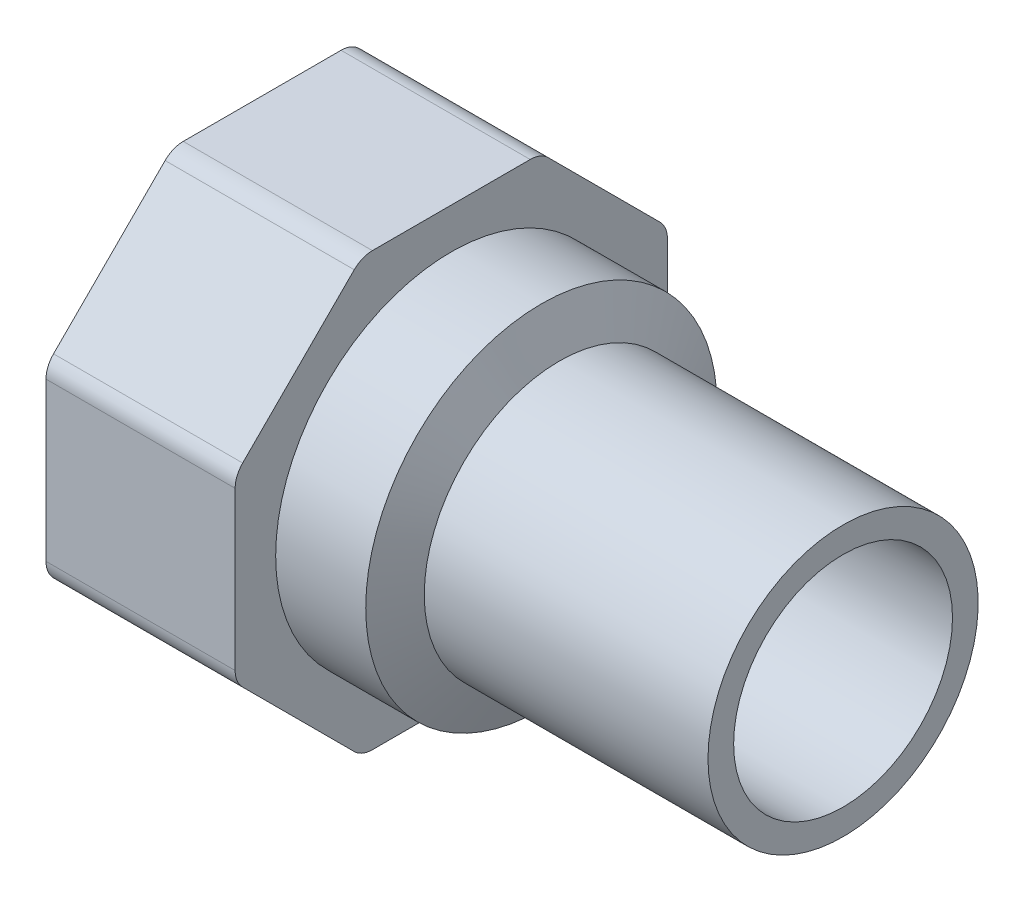
ISO-10303-21;
HEADER;
FILE_DESCRIPTION(('STEP AP214'),'2;1');
FILE_NAME('part.step','',(''),(''),'','','');
FILE_SCHEMA(('AUTOMOTIVE_DESIGN { 1 0 10303 214 1 1 1 1 }'));
ENDSEC;
DATA;
#1=APPLICATION_CONTEXT('core data for automotive mechanical design processes');
#2=APPLICATION_PROTOCOL_DEFINITION('international standard','automotive_design',2000,#1);
#3=PRODUCT_CONTEXT('',#1,'mechanical');
#4=PRODUCT('Part','Part','',(#3));
#5=PRODUCT_RELATED_PRODUCT_CATEGORY('part','',(#4));
#6=PRODUCT_DEFINITION_FORMATION('','',#4);
#7=PRODUCT_DEFINITION_CONTEXT('part definition',#1,'design');
#8=PRODUCT_DEFINITION('design','',#6,#7);
#9=PRODUCT_DEFINITION_SHAPE('','',#8);
#10=(LENGTH_UNIT() NAMED_UNIT(*) SI_UNIT(.MILLI.,.METRE.));
#11=(NAMED_UNIT(*) PLANE_ANGLE_UNIT() SI_UNIT($,.RADIAN.));
#12=(NAMED_UNIT(*) SI_UNIT($,.STERADIAN.) SOLID_ANGLE_UNIT());
#13=UNCERTAINTY_MEASURE_WITH_UNIT(LENGTH_MEASURE(1.E-05),#10,'distance_accuracy_value','');
#14=(GEOMETRIC_REPRESENTATION_CONTEXT(3) GLOBAL_UNCERTAINTY_ASSIGNED_CONTEXT((#13)) GLOBAL_UNIT_ASSIGNED_CONTEXT((#10,
#11,#12)) REPRESENTATION_CONTEXT('',''));
#15=CARTESIAN_POINT('',(0.,0.,0.));
#16=DIRECTION('',(0.,0.,1.));
#17=DIRECTION('',(1.,0.,0.));
#18=AXIS2_PLACEMENT_3D('',#15,#16,#17);
#19=CARTESIAN_POINT('',(-21.,0.,0.));
#20=DIRECTION('',(-1.,0.,0.));
#21=DIRECTION('',(0.,0.,1.));
#22=AXIS2_PLACEMENT_3D('',#19,#20,#21);
#23=CYLINDRICAL_SURFACE('',#22,10.);
#24=CARTESIAN_POINT('',(-21.,0.,0.));
#25=DIRECTION('',(1.,0.,0.));
#26=DIRECTION('',(0.,1.,0.));
#27=AXIS2_PLACEMENT_3D('',#24,#25,#26);
#28=CIRCLE('',#27,10.);
#29=CARTESIAN_POINT('',(-21.,10.,0.));
#30=VERTEX_POINT('',#29);
#31=EDGE_CURVE('E317',#30,#30,#28,.F.);
#32=ORIENTED_EDGE('',*,*,#31,.F.);
#33=EDGE_LOOP('',(#32));
#34=FACE_BOUND('',#33,.T.);
#35=CARTESIAN_POINT('',(0.,0.,0.));
#36=DIRECTION('',(-1.,0.,0.));
#37=DIRECTION('',(0.,0.,1.));
#38=AXIS2_PLACEMENT_3D('',#35,#36,#37);
#39=CIRCLE('',#38,10.);
#40=CARTESIAN_POINT('',(0.,0.,10.));
#41=VERTEX_POINT('',#40);
#42=EDGE_CURVE('E18',#41,#41,#39,.F.);
#43=ORIENTED_EDGE('',*,*,#42,.F.);
#44=EDGE_LOOP('',(#43));
#45=FACE_BOUND('',#44,.T.);
#46=ADVANCED_FACE('F15',(#34,#45),#23,.T.);
#47=CARTESIAN_POINT('',(-21.,0.,0.));
#48=DIRECTION('',(-1.,0.,0.));
#49=DIRECTION('',(0.,0.,1.));
#50=AXIS2_PLACEMENT_3D('',#47,#48,#49);
#51=CONICAL_SURFACE('',#50,10.,1.15257199721567);
#52=CARTESIAN_POINT('',(-22.3333333333333,0.,0.));
#53=DIRECTION('',(-1.,0.,0.));
#54=DIRECTION('',(0.,1.,0.));
#55=AXIS2_PLACEMENT_3D('',#52,#53,#54);
#56=CIRCLE('',#55,13.);
#57=CARTESIAN_POINT('',(-22.3333333333333,13.,0.));
#58=VERTEX_POINT('',#57);
#59=EDGE_CURVE('E309',#58,#58,#56,.T.);
#60=ORIENTED_EDGE('',*,*,#59,.F.);
#61=EDGE_LOOP('',(#60));
#62=FACE_BOUND('',#61,.T.);
#63=ORIENTED_EDGE('',*,*,#31,.T.);
#64=EDGE_LOOP('',(#63));
#65=FACE_BOUND('',#64,.T.);
#66=ADVANCED_FACE('F548',(#62,#65),#51,.T.);
#67=CARTESIAN_POINT('',(0.,10.,10.1200021082709));
#68=DIRECTION('',(1.,0.,0.));
#69=DIRECTION('',(0.,-1.,0.));
#70=AXIS2_PLACEMENT_3D('',#67,#68,#69);
#71=PLANE('',#70);
#72=CARTESIAN_POINT('',(0.,0.,0.));
#73=DIRECTION('',(-1.,0.,0.));
#74=DIRECTION('',(0.,0.,1.));
#75=AXIS2_PLACEMENT_3D('',#72,#73,#74);
#76=CIRCLE('',#75,8.1);
#77=CARTESIAN_POINT('',(0.,0.,8.1));
#78=VERTEX_POINT('',#77);
#79=EDGE_CURVE('E137',#78,#78,#76,.F.);
#80=ORIENTED_EDGE('',*,*,#79,.F.);
#81=EDGE_LOOP('',(#80));
#82=FACE_BOUND('',#81,.T.);
#83=ORIENTED_EDGE('',*,*,#42,.T.);
#84=EDGE_LOOP('',(#83));
#85=FACE_BOUND('',#84,.T.);
#86=ADVANCED_FACE('F540',(#82,#85),#71,.T.);
#87=CARTESIAN_POINT('',(-29.,0.,0.));
#88=DIRECTION('',(-1.,0.,0.));
#89=DIRECTION('',(0.,0.,1.));
#90=AXIS2_PLACEMENT_3D('',#87,#88,#89);
#91=CYLINDRICAL_SURFACE('',#90,13.);
#92=CARTESIAN_POINT('',(-29.,0.,0.));
#93=DIRECTION('',(-1.,0.,0.));
#94=DIRECTION('',(0.,0.,1.));
#95=AXIS2_PLACEMENT_3D('',#92,#93,#94);
#96=CIRCLE('',#95,13.);
#97=CARTESIAN_POINT('',(-29.,0.,13.));
#98=VERTEX_POINT('',#97);
#99=EDGE_CURVE('E285',#98,#98,#96,.T.);
#100=ORIENTED_EDGE('',*,*,#99,.F.);
#101=EDGE_LOOP('',(#100));
#102=FACE_BOUND('',#101,.T.);
#103=ORIENTED_EDGE('',*,*,#59,.T.);
#104=EDGE_LOOP('',(#103));
#105=FACE_BOUND('',#104,.T.);
#106=ADVANCED_FACE('F533',(#102,#105),#91,.T.);
#107=CARTESIAN_POINT('',(0.,0.,0.));
#108=DIRECTION('',(-1.,0.,0.));
#109=DIRECTION('',(0.,0.,1.));
#110=AXIS2_PLACEMENT_3D('',#107,#108,#109);
#111=CYLINDRICAL_SURFACE('',#110,8.1);
#112=ORIENTED_EDGE('',*,*,#79,.T.);
#113=EDGE_LOOP('',(#112));
#114=FACE_BOUND('',#113,.T.);
#115=CARTESIAN_POINT('',(-28.7868479254944,0.,0.));
#116=DIRECTION('',(1.,0.,0.));
#117=DIRECTION('',(0.,1.,0.));
#118=AXIS2_PLACEMENT_3D('',#115,#116,#117);
#119=CIRCLE('',#118,8.10000000000001);
#120=CARTESIAN_POINT('',(-28.7868479254944,8.10000000000001,0.));
#121=VERTEX_POINT('',#120);
#122=EDGE_CURVE('E165',#121,#121,#119,.T.);
#123=ORIENTED_EDGE('',*,*,#122,.F.);
#124=EDGE_LOOP('',(#123));
#125=FACE_BOUND('',#124,.T.);
#126=ADVANCED_FACE('F526',(#114,#125),#111,.F.);
#127=CARTESIAN_POINT('',(-29.,5.84041122946063,14.1));
#128=DIRECTION('',(1.,0.,0.));
#129=DIRECTION('',(0.,0.,-1.));
#130=AXIS2_PLACEMENT_3D('',#127,#128,#129);
#131=CYLINDRICAL_SURFACE('',#130,1.90000000000001);
#132=CARTESIAN_POINT('',(-43.,5.84041122946063,14.1));
#133=DIRECTION('',(1.,0.,0.));
#134=DIRECTION('',(0.,0.,-1.));
#135=AXIS2_PLACEMENT_3D('',#132,#133,#134);
#136=CIRCLE('',#135,1.90000000000001);
#137=CARTESIAN_POINT('',(-43.,7.18391411371508,15.4435028842544));
#138=VERTEX_POINT('',#137);
#139=CARTESIAN_POINT('',(-43.,5.84041122946063,16.));
#140=VERTEX_POINT('',#139);
#141=EDGE_CURVE('E125',#138,#140,#136,.T.);
#142=ORIENTED_EDGE('',*,*,#141,.T.);
#143=DIRECTION('',(1.,0.,0.));
#144=VECTOR('',#143,1.);
#145=CARTESIAN_POINT('',(-43.,5.84041122946064,16.));
#146=LINE('',#145,#144);
#147=CARTESIAN_POINT('',(-29.,5.84041122946063,16.));
#148=VERTEX_POINT('',#147);
#149=EDGE_CURVE('E131',#148,#140,#146,.F.);
#150=ORIENTED_EDGE('',*,*,#149,.F.);
#151=CARTESIAN_POINT('',(-29.,5.84041122946063,14.1));
#152=DIRECTION('',(1.,0.,0.));
#153=DIRECTION('',(0.,0.,-1.));
#154=AXIS2_PLACEMENT_3D('',#151,#152,#153);
#155=CIRCLE('',#154,1.90000000000001);
#156=CARTESIAN_POINT('',(-29.,7.18391411371508,15.4435028842544));
#157=VERTEX_POINT('',#156);
#158=EDGE_CURVE('E288',#157,#148,#155,.T.);
#159=ORIENTED_EDGE('',*,*,#158,.F.);
#160=DIRECTION('',(1.,0.,0.));
#161=VECTOR('',#160,1.);
#162=CARTESIAN_POINT('',(-43.,7.18391411371508,15.4435028842544));
#163=LINE('',#162,#161);
#164=EDGE_CURVE('E134',#138,#157,#163,.T.);
#165=ORIENTED_EDGE('',*,*,#164,.F.);
#166=EDGE_LOOP('',(#142,#150,#159,#165));
#167=FACE_BOUND('',#166,.T.);
#168=ADVANCED_FACE('F130',(#167),#131,.T.);
#169=CARTESIAN_POINT('',(-29.,14.1,5.84041122946064));
#170=DIRECTION('',(1.,0.,0.));
#171=DIRECTION('',(0.,0.,-1.));
#172=AXIS2_PLACEMENT_3D('',#169,#170,#171);
#173=CYLINDRICAL_SURFACE('',#172,1.90000000000001);
#174=CARTESIAN_POINT('',(-43.,14.1,5.84041122946064));
#175=DIRECTION('',(1.,0.,0.));
#176=DIRECTION('',(0.,0.,-1.));
#177=AXIS2_PLACEMENT_3D('',#174,#175,#176);
#178=CIRCLE('',#177,1.90000000000001);
#179=CARTESIAN_POINT('',(-43.,16.,5.84041122946064));
#180=VERTEX_POINT('',#179);
#181=CARTESIAN_POINT('',(-43.,15.4435028842544,7.18391411371509));
#182=VERTEX_POINT('',#181);
#183=EDGE_CURVE('E136',#180,#182,#178,.T.);
#184=ORIENTED_EDGE('',*,*,#183,.T.);
#185=DIRECTION('',(1.,0.,0.));
#186=VECTOR('',#185,1.);
#187=CARTESIAN_POINT('',(-43.,15.4435028842544,7.18391411371509));
#188=LINE('',#187,#186);
#189=CARTESIAN_POINT('',(-29.,15.4435028842544,7.18391411371509));
#190=VERTEX_POINT('',#189);
#191=EDGE_CURVE('E170',#190,#182,#188,.F.);
#192=ORIENTED_EDGE('',*,*,#191,.F.);
#193=CARTESIAN_POINT('',(-29.,14.1,5.84041122946064));
#194=DIRECTION('',(1.,0.,0.));
#195=DIRECTION('',(0.,0.,-1.));
#196=AXIS2_PLACEMENT_3D('',#193,#194,#195);
#197=CIRCLE('',#196,1.90000000000001);
#198=CARTESIAN_POINT('',(-29.,16.,5.84041122946064));
#199=VERTEX_POINT('',#198);
#200=EDGE_CURVE('E290',#199,#190,#197,.T.);
#201=ORIENTED_EDGE('',*,*,#200,.F.);
#202=DIRECTION('',(1.,0.,0.));
#203=VECTOR('',#202,1.);
#204=CARTESIAN_POINT('',(-43.,16.,5.84041122946065));
#205=LINE('',#204,#203);
#206=EDGE_CURVE('E178',#180,#199,#205,.T.);
#207=ORIENTED_EDGE('',*,*,#206,.F.);
#208=EDGE_LOOP('',(#184,#192,#201,#207));
#209=FACE_BOUND('',#208,.T.);
#210=ADVANCED_FACE('F511',(#209),#173,.T.);
#211=CARTESIAN_POINT('',(-29.,14.1,-5.84041122946064));
#212=DIRECTION('',(1.,0.,0.));
#213=DIRECTION('',(0.,0.,-1.));
#214=AXIS2_PLACEMENT_3D('',#211,#212,#213);
#215=CYLINDRICAL_SURFACE('',#214,1.89999999999998);
#216=CARTESIAN_POINT('',(-43.,14.1,-5.84041122946064));
#217=DIRECTION('',(1.,0.,0.));
#218=DIRECTION('',(0.,0.,-1.));
#219=AXIS2_PLACEMENT_3D('',#216,#217,#218);
#220=CIRCLE('',#219,1.89999999999998);
#221=CARTESIAN_POINT('',(-43.,15.4435028842544,-7.18391411371507));
#222=VERTEX_POINT('',#221);
#223=CARTESIAN_POINT('',(-43.,16.,-5.84041122946063));
#224=VERTEX_POINT('',#223);
#225=EDGE_CURVE('E306',#222,#224,#220,.T.);
#226=ORIENTED_EDGE('',*,*,#225,.T.);
#227=DIRECTION('',(1.,0.,0.));
#228=VECTOR('',#227,1.);
#229=CARTESIAN_POINT('',(-43.,16.,-5.84041122946063));
#230=LINE('',#229,#228);
#231=CARTESIAN_POINT('',(-29.,16.,-5.84041122946063));
#232=VERTEX_POINT('',#231);
#233=EDGE_CURVE('E177',#232,#224,#230,.F.);
#234=ORIENTED_EDGE('',*,*,#233,.F.);
#235=CARTESIAN_POINT('',(-29.,14.1,-5.84041122946064));
#236=DIRECTION('',(1.,0.,0.));
#237=DIRECTION('',(0.,0.,-1.));
#238=AXIS2_PLACEMENT_3D('',#235,#236,#237);
#239=CIRCLE('',#238,1.89999999999998);
#240=CARTESIAN_POINT('',(-29.,15.4435028842544,-7.18391411371507));
#241=VERTEX_POINT('',#240);
#242=EDGE_CURVE('E292',#241,#232,#239,.T.);
#243=ORIENTED_EDGE('',*,*,#242,.F.);
#244=DIRECTION('',(1.,0.,0.));
#245=VECTOR('',#244,1.);
#246=CARTESIAN_POINT('',(-43.,15.4435028842544,-7.18391411371507));
#247=LINE('',#246,#245);
#248=EDGE_CURVE('E187',#222,#241,#247,.T.);
#249=ORIENTED_EDGE('',*,*,#248,.F.);
#250=EDGE_LOOP('',(#226,#234,#243,#249));
#251=FACE_BOUND('',#250,.T.);
#252=ADVANCED_FACE('F503',(#251),#215,.T.);
#253=CARTESIAN_POINT('',(-29.,5.84041122946063,-14.1));
#254=DIRECTION('',(1.,0.,0.));
#255=DIRECTION('',(0.,0.,-1.));
#256=AXIS2_PLACEMENT_3D('',#253,#254,#255);
#257=CYLINDRICAL_SURFACE('',#256,1.90000000000001);
#258=CARTESIAN_POINT('',(-43.,5.84041122946063,-14.1));
#259=DIRECTION('',(1.,0.,0.));
#260=DIRECTION('',(0.,0.,-1.));
#261=AXIS2_PLACEMENT_3D('',#258,#259,#260);
#262=CIRCLE('',#261,1.90000000000001);
#263=CARTESIAN_POINT('',(-43.,5.84041122946063,-16.));
#264=VERTEX_POINT('',#263);
#265=CARTESIAN_POINT('',(-43.,7.18391411371508,-15.4435028842544));
#266=VERTEX_POINT('',#265);
#267=EDGE_CURVE('E304',#264,#266,#262,.T.);
#268=ORIENTED_EDGE('',*,*,#267,.T.);
#269=DIRECTION('',(1.,0.,0.));
#270=VECTOR('',#269,1.);
#271=CARTESIAN_POINT('',(-43.,7.18391411371508,-15.4435028842544));
#272=LINE('',#271,#270);
#273=CARTESIAN_POINT('',(-29.,7.18391411371508,-15.4435028842544));
#274=VERTEX_POINT('',#273);
#275=EDGE_CURVE('E186',#274,#266,#272,.F.);
#276=ORIENTED_EDGE('',*,*,#275,.F.);
#277=CARTESIAN_POINT('',(-29.,5.84041122946063,-14.1));
#278=DIRECTION('',(1.,0.,0.));
#279=DIRECTION('',(0.,0.,-1.));
#280=AXIS2_PLACEMENT_3D('',#277,#278,#279);
#281=CIRCLE('',#280,1.90000000000001);
#282=CARTESIAN_POINT('',(-29.,5.84041122946063,-16.));
#283=VERTEX_POINT('',#282);
#284=EDGE_CURVE('E294',#283,#274,#281,.T.);
#285=ORIENTED_EDGE('',*,*,#284,.F.);
#286=DIRECTION('',(1.,0.,0.));
#287=VECTOR('',#286,1.);
#288=CARTESIAN_POINT('',(-43.,5.84041122946064,-16.));
#289=LINE('',#288,#287);
#290=EDGE_CURVE('E196',#264,#283,#289,.T.);
#291=ORIENTED_EDGE('',*,*,#290,.F.);
#292=EDGE_LOOP('',(#268,#276,#285,#291));
#293=FACE_BOUND('',#292,.T.);
#294=ADVANCED_FACE('F495',(#293),#257,.T.);
#295=CARTESIAN_POINT('',(-29.,-5.84041122946063,-14.1));
#296=DIRECTION('',(1.,0.,0.));
#297=DIRECTION('',(0.,0.,-1.));
#298=AXIS2_PLACEMENT_3D('',#295,#296,#297);
#299=CYLINDRICAL_SURFACE('',#298,1.9);
#300=CARTESIAN_POINT('',(-43.,-5.84041122946063,-14.1));
#301=DIRECTION('',(1.,0.,0.));
#302=DIRECTION('',(0.,0.,-1.));
#303=AXIS2_PLACEMENT_3D('',#300,#301,#302);
#304=CIRCLE('',#303,1.9);
#305=CARTESIAN_POINT('',(-43.,-7.18391411371507,-15.4435028842544));
#306=VERTEX_POINT('',#305);
#307=CARTESIAN_POINT('',(-43.,-5.84041122946063,-16.));
#308=VERTEX_POINT('',#307);
#309=EDGE_CURVE('E302',#306,#308,#304,.T.);
#310=ORIENTED_EDGE('',*,*,#309,.T.);
#311=DIRECTION('',(1.,0.,0.));
#312=VECTOR('',#311,1.);
#313=CARTESIAN_POINT('',(-43.,-5.84041122946063,-16.));
#314=LINE('',#313,#312);
#315=CARTESIAN_POINT('',(-29.,-5.84041122946063,-16.));
#316=VERTEX_POINT('',#315);
#317=EDGE_CURVE('E195',#316,#308,#314,.F.);
#318=ORIENTED_EDGE('',*,*,#317,.F.);
#319=CARTESIAN_POINT('',(-29.,-5.84041122946063,-14.1));
#320=DIRECTION('',(1.,0.,0.));
#321=DIRECTION('',(0.,0.,-1.));
#322=AXIS2_PLACEMENT_3D('',#319,#320,#321);
#323=CIRCLE('',#322,1.9);
#324=CARTESIAN_POINT('',(-29.,-7.18391411371507,-15.4435028842544));
#325=VERTEX_POINT('',#324);
#326=EDGE_CURVE('E296',#325,#316,#323,.T.);
#327=ORIENTED_EDGE('',*,*,#326,.F.);
#328=DIRECTION('',(1.,0.,0.));
#329=VECTOR('',#328,1.);
#330=CARTESIAN_POINT('',(-43.,-7.18391411371507,-15.4435028842544));
#331=LINE('',#330,#329);
#332=EDGE_CURVE('E205',#306,#325,#331,.T.);
#333=ORIENTED_EDGE('',*,*,#332,.F.);
#334=EDGE_LOOP('',(#310,#318,#327,#333));
#335=FACE_BOUND('',#334,.T.);
#336=ADVANCED_FACE('F487',(#335),#299,.T.);
#337=CARTESIAN_POINT('',(-29.,-14.1,-5.84041122946064));
#338=DIRECTION('',(1.,0.,0.));
#339=DIRECTION('',(0.,0.,-1.));
#340=AXIS2_PLACEMENT_3D('',#337,#338,#339);
#341=CYLINDRICAL_SURFACE('',#340,1.9);
#342=CARTESIAN_POINT('',(-43.,-14.1,-5.84041122946064));
#343=DIRECTION('',(1.,0.,0.));
#344=DIRECTION('',(0.,0.,-1.));
#345=AXIS2_PLACEMENT_3D('',#342,#343,#344);
#346=CIRCLE('',#345,1.9);
#347=CARTESIAN_POINT('',(-43.,-16.,-5.84041122946064));
#348=VERTEX_POINT('',#347);
#349=CARTESIAN_POINT('',(-43.,-15.4435028842544,-7.18391411371508));
#350=VERTEX_POINT('',#349);
#351=EDGE_CURVE('E300',#348,#350,#346,.T.);
#352=ORIENTED_EDGE('',*,*,#351,.T.);
#353=DIRECTION('',(1.,0.,0.));
#354=VECTOR('',#353,1.);
#355=CARTESIAN_POINT('',(-43.,-15.4435028842544,-7.18391411371508));
#356=LINE('',#355,#354);
#357=CARTESIAN_POINT('',(-29.,-15.4435028842544,-7.18391411371508));
#358=VERTEX_POINT('',#357);
#359=EDGE_CURVE('E204',#358,#350,#356,.F.);
#360=ORIENTED_EDGE('',*,*,#359,.F.);
#361=CARTESIAN_POINT('',(-29.,-14.1,-5.84041122946064));
#362=DIRECTION('',(1.,0.,0.));
#363=DIRECTION('',(0.,0.,-1.));
#364=AXIS2_PLACEMENT_3D('',#361,#362,#363);
#365=CIRCLE('',#364,1.9);
#366=CARTESIAN_POINT('',(-29.,-16.,-5.84041122946064));
#367=VERTEX_POINT('',#366);
#368=EDGE_CURVE('E298',#367,#358,#365,.T.);
#369=ORIENTED_EDGE('',*,*,#368,.F.);
#370=DIRECTION('',(1.,0.,0.));
#371=VECTOR('',#370,1.);
#372=CARTESIAN_POINT('',(-43.,-16.,-5.84041122946065));
#373=LINE('',#372,#371);
#374=EDGE_CURVE('E211',#348,#367,#373,.T.);
#375=ORIENTED_EDGE('',*,*,#374,.F.);
#376=EDGE_LOOP('',(#352,#360,#369,#375));
#377=FACE_BOUND('',#376,.T.);
#378=ADVANCED_FACE('F479',(#377),#341,.T.);
#379=CARTESIAN_POINT('',(-29.,16.,16.));
#380=DIRECTION('',(1.,0.,0.));
#381=DIRECTION('',(0.,-1.,0.));
#382=AXIS2_PLACEMENT_3D('',#379,#380,#381);
#383=PLANE('',#382);
#384=ORIENTED_EDGE('',*,*,#99,.T.);
#385=EDGE_LOOP('',(#384));
#386=FACE_BOUND('',#385,.T.);
#387=ORIENTED_EDGE('',*,*,#158,.T.);
#388=DIRECTION('',(0.,1.,0.));
#389=VECTOR('',#388,1.);
#390=CARTESIAN_POINT('',(-29.,0.,16.));
#391=LINE('',#390,#389);
#392=CARTESIAN_POINT('',(-29.,-5.84041122946064,16.));
#393=VERTEX_POINT('',#392);
#394=EDGE_CURVE('E144',#393,#148,#391,.T.);
#395=ORIENTED_EDGE('',*,*,#394,.F.);
#396=CARTESIAN_POINT('',(-29.,-5.84041122946064,14.1));
#397=DIRECTION('',(1.,0.,0.));
#398=DIRECTION('',(0.,0.,-1.));
#399=AXIS2_PLACEMENT_3D('',#396,#397,#398);
#400=CIRCLE('',#399,1.89999999999999);
#401=CARTESIAN_POINT('',(-29.,-7.18391411371508,15.4435028842544));
#402=VERTEX_POINT('',#401);
#403=EDGE_CURVE('E276',#402,#393,#400,.F.);
#404=ORIENTED_EDGE('',*,*,#403,.F.);
#405=DIRECTION('',(0.,0.707106781186547,0.707106781186548));
#406=VECTOR('',#405,1.);
#407=CARTESIAN_POINT('',(-29.,-11.3137084989848,11.3137084989848));
#408=LINE('',#407,#406);
#409=CARTESIAN_POINT('',(-29.,-15.4435028842544,7.18391411371507));
#410=VERTEX_POINT('',#409);
#411=EDGE_CURVE('E164',#410,#402,#408,.T.);
#412=ORIENTED_EDGE('',*,*,#411,.F.);
#413=CARTESIAN_POINT('',(-29.,-14.1,5.84041122946064));
#414=DIRECTION('',(1.,0.,0.));
#415=DIRECTION('',(0.,0.,-1.));
#416=AXIS2_PLACEMENT_3D('',#413,#414,#415);
#417=CIRCLE('',#416,1.89999999999999);
#418=CARTESIAN_POINT('',(-29.,-16.,5.84041122946063));
#419=VERTEX_POINT('',#418);
#420=EDGE_CURVE('E273',#419,#410,#417,.F.);
#421=ORIENTED_EDGE('',*,*,#420,.F.);
#422=DIRECTION('',(0.,0.,1.));
#423=VECTOR('',#422,1.);
#424=CARTESIAN_POINT('',(-29.,-16.,0.));
#425=LINE('',#424,#423);
#426=EDGE_CURVE('E208',#367,#419,#425,.T.);
#427=ORIENTED_EDGE('',*,*,#426,.F.);
#428=ORIENTED_EDGE('',*,*,#368,.T.);
#429=DIRECTION('',(0.,-0.707106781186547,0.707106781186548));
#430=VECTOR('',#429,1.);
#431=CARTESIAN_POINT('',(-29.,-11.3137084989847,-11.3137084989848));
#432=LINE('',#431,#430);
#433=EDGE_CURVE('E199',#325,#358,#432,.T.);
#434=ORIENTED_EDGE('',*,*,#433,.F.);
#435=ORIENTED_EDGE('',*,*,#326,.T.);
#436=DIRECTION('',(0.,-1.,0.));
#437=VECTOR('',#436,1.);
#438=CARTESIAN_POINT('',(-29.,0.,-16.));
#439=LINE('',#438,#437);
#440=EDGE_CURVE('E190',#283,#316,#439,.T.);
#441=ORIENTED_EDGE('',*,*,#440,.F.);
#442=ORIENTED_EDGE('',*,*,#284,.T.);
#443=DIRECTION('',(0.,-0.707106781186547,-0.707106781186548));
#444=VECTOR('',#443,1.);
#445=CARTESIAN_POINT('',(-29.,11.3137084989848,-11.3137084989848));
#446=LINE('',#445,#444);
#447=EDGE_CURVE('E181',#241,#274,#446,.T.);
#448=ORIENTED_EDGE('',*,*,#447,.F.);
#449=ORIENTED_EDGE('',*,*,#242,.T.);
#450=DIRECTION('',(0.,0.,-1.));
#451=VECTOR('',#450,1.);
#452=CARTESIAN_POINT('',(-29.,16.,0.));
#453=LINE('',#452,#451);
#454=EDGE_CURVE('E172',#199,#232,#453,.T.);
#455=ORIENTED_EDGE('',*,*,#454,.F.);
#456=ORIENTED_EDGE('',*,*,#200,.T.);
#457=DIRECTION('',(0.,0.707106781186547,-0.707106781186548));
#458=VECTOR('',#457,1.);
#459=CARTESIAN_POINT('',(-29.,11.3137084989848,11.3137084989848));
#460=LINE('',#459,#458);
#461=EDGE_CURVE('E167',#157,#190,#460,.T.);
#462=ORIENTED_EDGE('',*,*,#461,.F.);
#463=EDGE_LOOP('',(#387,#395,#404,#412,#421,#427,#428,#434,#435,#441,#442,#448,#449,#455,#456,#462));
#464=FACE_BOUND('',#463,.T.);
#465=ADVANCED_FACE('F271',(#386,#464),#383,.T.);
#466=CARTESIAN_POINT('',(-29.,-5.84041122946064,14.1));
#467=DIRECTION('',(1.,0.,0.));
#468=DIRECTION('',(0.,0.,-1.));
#469=AXIS2_PLACEMENT_3D('',#466,#467,#468);
#470=CYLINDRICAL_SURFACE('',#469,1.89999999999999);
#471=CARTESIAN_POINT('',(-43.,-5.84041122946064,14.1));
#472=DIRECTION('',(1.,0.,0.));
#473=DIRECTION('',(0.,0.,-1.));
#474=AXIS2_PLACEMENT_3D('',#471,#472,#473);
#475=CIRCLE('',#474,1.89999999999999);
#476=CARTESIAN_POINT('',(-43.,-5.84041122946064,16.));
#477=VERTEX_POINT('',#476);
#478=CARTESIAN_POINT('',(-43.,-7.18391411371508,15.4435028842544));
#479=VERTEX_POINT('',#478);
#480=EDGE_CURVE('E148',#477,#479,#475,.T.);
#481=ORIENTED_EDGE('',*,*,#480,.T.);
#482=DIRECTION('',(1.,0.,0.));
#483=VECTOR('',#482,1.);
#484=CARTESIAN_POINT('',(-43.,-7.18391411371508,15.4435028842544));
#485=LINE('',#484,#483);
#486=EDGE_CURVE('E161',#402,#479,#485,.F.);
#487=ORIENTED_EDGE('',*,*,#486,.F.);
#488=ORIENTED_EDGE('',*,*,#403,.T.);
#489=DIRECTION('',(1.,0.,0.));
#490=VECTOR('',#489,1.);
#491=CARTESIAN_POINT('',(-43.,-5.84041122946064,16.));
#492=LINE('',#491,#490);
#493=EDGE_CURVE('E145',#477,#393,#492,.T.);
#494=ORIENTED_EDGE('',*,*,#493,.F.);
#495=EDGE_LOOP('',(#481,#487,#488,#494));
#496=FACE_BOUND('',#495,.T.);
#497=ADVANCED_FACE('F465',(#496),#470,.T.);
#498=CARTESIAN_POINT('',(-29.,-14.1,5.84041122946064));
#499=DIRECTION('',(1.,0.,0.));
#500=DIRECTION('',(0.,0.,-1.));
#501=AXIS2_PLACEMENT_3D('',#498,#499,#500);
#502=CYLINDRICAL_SURFACE('',#501,1.89999999999999);
#503=CARTESIAN_POINT('',(-43.,-14.1,5.84041122946064));
#504=DIRECTION('',(1.,0.,0.));
#505=DIRECTION('',(0.,0.,-1.));
#506=AXIS2_PLACEMENT_3D('',#503,#504,#505);
#507=CIRCLE('',#506,1.89999999999999);
#508=CARTESIAN_POINT('',(-43.,-15.4435028842544,7.18391411371507));
#509=VERTEX_POINT('',#508);
#510=CARTESIAN_POINT('',(-43.,-16.,5.84041122946063));
#511=VERTEX_POINT('',#510);
#512=EDGE_CURVE('E33',#509,#511,#507,.T.);
#513=ORIENTED_EDGE('',*,*,#512,.T.);
#514=DIRECTION('',(1.,0.,0.));
#515=VECTOR('',#514,1.);
#516=CARTESIAN_POINT('',(-43.,-16.,5.84041122946063));
#517=LINE('',#516,#515);
#518=EDGE_CURVE('E214',#419,#511,#517,.F.);
#519=ORIENTED_EDGE('',*,*,#518,.F.);
#520=ORIENTED_EDGE('',*,*,#420,.T.);
#521=DIRECTION('',(1.,0.,0.));
#522=VECTOR('',#521,1.);
#523=CARTESIAN_POINT('',(-43.,-15.4435028842544,7.18391411371507));
#524=LINE('',#523,#522);
#525=EDGE_CURVE('E156',#509,#410,#524,.T.);
#526=ORIENTED_EDGE('',*,*,#525,.F.);
#527=EDGE_LOOP('',(#513,#519,#520,#526));
#528=FACE_BOUND('',#527,.T.);
#529=ADVANCED_FACE('F278',(#528),#502,.T.);
#530=CARTESIAN_POINT('',(-29.,0.,0.));
#531=DIRECTION('',(-1.,0.,0.));
#532=DIRECTION('',(0.,0.,1.));
#533=AXIS2_PLACEMENT_3D('',#530,#531,#532);
#534=CONICAL_SURFACE('',#533,8.46919022278247,1.0471975511966);
#535=ORIENTED_EDGE('',*,*,#122,.T.);
#536=EDGE_LOOP('',(#535));
#537=FACE_BOUND('',#536,.T.);
#538=CARTESIAN_POINT('',(-29.,0.,0.));
#539=DIRECTION('',(1.,0.,0.));
#540=DIRECTION('',(0.,1.,0.));
#541=AXIS2_PLACEMENT_3D('',#538,#539,#540);
#542=CIRCLE('',#541,8.46919022278247);
#543=CARTESIAN_POINT('',(-29.,8.46919022278247,0.));
#544=VERTEX_POINT('',#543);
#545=EDGE_CURVE('E151',#544,#544,#542,.T.);
#546=ORIENTED_EDGE('',*,*,#545,.F.);
#547=EDGE_LOOP('',(#546));
#548=FACE_BOUND('',#547,.T.);
#549=ADVANCED_FACE('F451',(#537,#548),#534,.F.);
#550=CARTESIAN_POINT('',(-43.,5.84041122946064,16.));
#551=DIRECTION('',(0.,0.,1.));
#552=DIRECTION('',(0.,-1.,0.));
#553=AXIS2_PLACEMENT_3D('',#550,#551,#552);
#554=PLANE('',#553);
#555=DIRECTION('',(0.,1.,0.));
#556=VECTOR('',#555,1.);
#557=CARTESIAN_POINT('',(-43.,0.,16.));
#558=LINE('',#557,#556);
#559=EDGE_CURVE('E143',#477,#140,#558,.T.);
#560=ORIENTED_EDGE('',*,*,#559,.F.);
#561=ORIENTED_EDGE('',*,*,#493,.T.);
#562=ORIENTED_EDGE('',*,*,#394,.T.);
#563=ORIENTED_EDGE('',*,*,#149,.T.);
#564=EDGE_LOOP('',(#560,#561,#562,#563));
#565=FACE_BOUND('',#564,.T.);
#566=ADVANCED_FACE('F141',(#565),#554,.T.);
#567=CARTESIAN_POINT('',(-43.,15.4435028842544,7.18391411371509));
#568=DIRECTION('',(0.,0.707106781186548,0.707106781186547));
#569=DIRECTION('',(0.,-0.707106781186547,0.707106781186548));
#570=AXIS2_PLACEMENT_3D('',#567,#568,#569);
#571=PLANE('',#570);
#572=CARTESIAN_POINT('',(-43.,7.18391411371508,15.4435028842544));
#573=CARTESIAN_POINT('',(-43.,7.52806364582089,15.0993533521486));
#574=CARTESIAN_POINT('',(-43.,7.87221317792669,14.7552038200428));
#575=CARTESIAN_POINT('',(-43.,8.56051224213831,14.0669047558312));
#576=CARTESIAN_POINT('',(-43.,8.90466177424411,13.7227552237254));
#577=CARTESIAN_POINT('',(-43.,9.59296083845572,13.0344561595138));
#578=CARTESIAN_POINT('',(-43.,9.93711037056153,12.690306627408));
#579=CARTESIAN_POINT('',(-43.,10.6254094347731,12.0020075631964));
#580=CARTESIAN_POINT('',(-43.,10.9695589668789,11.6578580310906));
#581=CARTESIAN_POINT('',(-43.,11.6578580310906,10.969558966879));
#582=CARTESIAN_POINT('',(-43.,12.0020075631964,10.6254094347732));
#583=CARTESIAN_POINT('',(-43.,12.690306627408,9.93711037056154));
#584=CARTESIAN_POINT('',(-43.,13.0344561595138,9.59296083845573));
#585=CARTESIAN_POINT('',(-43.,13.7227552237254,8.90466177424412));
#586=CARTESIAN_POINT('',(-43.,14.0669047558312,8.56051224213831));
#587=CARTESIAN_POINT('',(-43.,14.7552038200428,7.8722131779267));
#588=CARTESIAN_POINT('',(-43.,15.0993533521486,7.5280636458209));
#589=CARTESIAN_POINT('',(-43.,15.4435028842544,7.18391411371509));
#590=B_SPLINE_CURVE_WITH_KNOTS('',3,(#572,#573,#574,#575,#576,#577,#578,#579,#580,#581,#582,
#583,#584,#585,#586,#587,#588,#589),.UNSPECIFIED.,.F.,.F.,(4,2,2,2,2,2,2,2,4),(0.,
1.46010280736516,2.92020561473032,4.38030842209548,5.84041122946063,7.3005140368258,
8.76061684419095,10.2207196515561,11.6808224589213),.UNSPECIFIED.);
#591=EDGE_CURVE('E150',#138,#182,#590,.T.);
#592=ORIENTED_EDGE('',*,*,#591,.F.);
#593=ORIENTED_EDGE('',*,*,#164,.T.);
#594=ORIENTED_EDGE('',*,*,#461,.T.);
#595=ORIENTED_EDGE('',*,*,#191,.T.);
#596=EDGE_LOOP('',(#592,#593,#594,#595));
#597=FACE_BOUND('',#596,.T.);
#598=ADVANCED_FACE('F436',(#597),#571,.T.);
#599=CARTESIAN_POINT('',(-43.,16.,-5.84041122946063));
#600=DIRECTION('',(0.,1.,0.));
#601=DIRECTION('',(0.,0.,1.));
#602=AXIS2_PLACEMENT_3D('',#599,#600,#601);
#603=PLANE('',#602);
#604=DIRECTION('',(0.,0.,-1.));
#605=VECTOR('',#604,1.);
#606=CARTESIAN_POINT('',(-43.,16.,16.));
#607=LINE('',#606,#605);
#608=EDGE_CURVE('E153',#180,#224,#607,.T.);
#609=ORIENTED_EDGE('',*,*,#608,.F.);
#610=ORIENTED_EDGE('',*,*,#206,.T.);
#611=ORIENTED_EDGE('',*,*,#454,.T.);
#612=ORIENTED_EDGE('',*,*,#233,.T.);
#613=EDGE_LOOP('',(#609,#610,#611,#612));
#614=FACE_BOUND('',#613,.T.);
#615=ADVANCED_FACE('F428',(#614),#603,.T.);
#616=CARTESIAN_POINT('',(-43.,7.18391411371508,-15.4435028842544));
#617=DIRECTION('',(0.,0.707106781186548,-0.707106781186547));
#618=DIRECTION('',(0.,0.707106781186547,0.707106781186548));
#619=AXIS2_PLACEMENT_3D('',#616,#617,#618);
#620=PLANE('',#619);
#621=CARTESIAN_POINT('',(-43.,15.4435028842544,-7.18391411371507));
#622=CARTESIAN_POINT('',(-43.,15.0993533521486,-7.52806364582088));
#623=CARTESIAN_POINT('',(-43.,14.7552038200428,-7.87221317792668));
#624=CARTESIAN_POINT('',(-43.,14.0669047558312,-8.56051224213829));
#625=CARTESIAN_POINT('',(-43.,13.7227552237254,-8.9046617742441));
#626=CARTESIAN_POINT('',(-43.,13.0344561595138,-9.59296083845572));
#627=CARTESIAN_POINT('',(-43.,12.690306627408,-9.93711037056153));
#628=CARTESIAN_POINT('',(-43.,12.0020075631964,-10.6254094347731));
#629=CARTESIAN_POINT('',(-43.,11.6578580310906,-10.9695589668789));
#630=CARTESIAN_POINT('',(-43.,10.9695589668789,-11.6578580310906));
#631=CARTESIAN_POINT('',(-43.,10.6254094347731,-12.0020075631964));
#632=CARTESIAN_POINT('',(-43.,9.93711037056153,-12.690306627408));
#633=CARTESIAN_POINT('',(-43.,9.59296083845572,-13.0344561595138));
#634=CARTESIAN_POINT('',(-43.,8.90466177424411,-13.7227552237254));
#635=CARTESIAN_POINT('',(-43.,8.56051224213831,-14.0669047558312));
#636=CARTESIAN_POINT('',(-43.,7.87221317792669,-14.7552038200428));
#637=CARTESIAN_POINT('',(-43.,7.52806364582089,-15.0993533521486));
#638=CARTESIAN_POINT('',(-43.,7.18391411371508,-15.4435028842544));
#639=B_SPLINE_CURVE_WITH_KNOTS('',3,(#621,#622,#623,#624,#625,#626,#627,#628,#629,#630,#631,
#632,#633,#634,#635,#636,#637,#638),.UNSPECIFIED.,.F.,.F.,(4,2,2,2,2,2,2,2,4),(0.,
1.46010280736516,2.92020561473032,4.38030842209548,5.84041122946064,7.3005140368258,
8.76061684419096,10.2207196515561,11.6808224589213),.UNSPECIFIED.);
#640=EDGE_CURVE('E587',#222,#266,#639,.T.);
#641=ORIENTED_EDGE('',*,*,#640,.F.);
#642=ORIENTED_EDGE('',*,*,#248,.T.);
#643=ORIENTED_EDGE('',*,*,#447,.T.);
#644=ORIENTED_EDGE('',*,*,#275,.T.);
#645=EDGE_LOOP('',(#641,#642,#643,#644));
#646=FACE_BOUND('',#645,.T.);
#647=ADVANCED_FACE('F420',(#646),#620,.T.);
#648=CARTESIAN_POINT('',(-43.,-5.84041122946063,-16.));
#649=DIRECTION('',(0.,0.,-1.));
#650=DIRECTION('',(0.,1.,0.));
#651=AXIS2_PLACEMENT_3D('',#648,#649,#650);
#652=PLANE('',#651);
#653=DIRECTION('',(0.,-1.,0.));
#654=VECTOR('',#653,1.);
#655=CARTESIAN_POINT('',(-43.,0.,-16.));
#656=LINE('',#655,#654);
#657=EDGE_CURVE('E221',#264,#308,#656,.T.);
#658=ORIENTED_EDGE('',*,*,#657,.F.);
#659=ORIENTED_EDGE('',*,*,#290,.T.);
#660=ORIENTED_EDGE('',*,*,#440,.T.);
#661=ORIENTED_EDGE('',*,*,#317,.T.);
#662=EDGE_LOOP('',(#658,#659,#660,#661));
#663=FACE_BOUND('',#662,.T.);
#664=ADVANCED_FACE('F412',(#663),#652,.T.);
#665=CARTESIAN_POINT('',(-43.,-15.4435028842544,-7.18391411371508));
#666=DIRECTION('',(0.,-0.707106781186548,-0.707106781186547));
#667=DIRECTION('',(0.,0.707106781186547,-0.707106781186548));
#668=AXIS2_PLACEMENT_3D('',#665,#666,#667);
#669=PLANE('',#668);
#670=CARTESIAN_POINT('',(-43.,-7.18391411371507,-15.4435028842544));
#671=CARTESIAN_POINT('',(-43.,-7.52806364582087,-15.0993533521486));
#672=CARTESIAN_POINT('',(-43.,-7.87221317792668,-14.7552038200428));
#673=CARTESIAN_POINT('',(-43.,-8.56051224213829,-14.0669047558312));
#674=CARTESIAN_POINT('',(-43.,-8.9046617742441,-13.7227552237254));
#675=CARTESIAN_POINT('',(-43.,-9.59296083845571,-13.0344561595138));
#676=CARTESIAN_POINT('',(-43.,-9.93711037056152,-12.690306627408));
#677=CARTESIAN_POINT('',(-43.,-10.6254094347731,-12.0020075631964));
#678=CARTESIAN_POINT('',(-43.,-10.9695589668789,-11.6578580310906));
#679=CARTESIAN_POINT('',(-43.,-11.6578580310905,-10.9695589668789));
#680=CARTESIAN_POINT('',(-43.,-12.0020075631964,-10.6254094347731));
#681=CARTESIAN_POINT('',(-43.,-12.690306627408,-9.93711037056153));
#682=CARTESIAN_POINT('',(-43.,-13.0344561595138,-9.59296083845572));
#683=CARTESIAN_POINT('',(-43.,-13.7227552237254,-8.90466177424411));
#684=CARTESIAN_POINT('',(-43.,-14.0669047558312,-8.56051224213831));
#685=CARTESIAN_POINT('',(-43.,-14.7552038200428,-7.87221317792669));
#686=CARTESIAN_POINT('',(-43.,-15.0993533521486,-7.52806364582089));
#687=CARTESIAN_POINT('',(-43.,-15.4435028842544,-7.18391411371508));
#688=B_SPLINE_CURVE_WITH_KNOTS('',3,(#670,#671,#672,#673,#674,#675,#676,#677,#678,#679,#680,
#681,#682,#683,#684,#685,#686,#687),.UNSPECIFIED.,.F.,.F.,(4,2,2,2,2,2,2,2,4),(0.,
1.46010280736516,2.92020561473031,4.38030842209548,5.84041122946063,7.30051403682579,
8.76061684419095,10.2207196515561,11.6808224589213),.UNSPECIFIED.);
#689=EDGE_CURVE('E215',#306,#350,#688,.T.);
#690=ORIENTED_EDGE('',*,*,#689,.F.);
#691=ORIENTED_EDGE('',*,*,#332,.T.);
#692=ORIENTED_EDGE('',*,*,#433,.T.);
#693=ORIENTED_EDGE('',*,*,#359,.T.);
#694=EDGE_LOOP('',(#690,#691,#692,#693));
#695=FACE_BOUND('',#694,.T.);
#696=ADVANCED_FACE('F404',(#695),#669,.T.);
#697=CARTESIAN_POINT('',(-43.,-16.,5.84041122946063));
#698=DIRECTION('',(0.,-1.,0.));
#699=DIRECTION('',(0.,0.,-1.));
#700=AXIS2_PLACEMENT_3D('',#697,#698,#699);
#701=PLANE('',#700);
#702=DIRECTION('',(0.,0.,-1.));
#703=VECTOR('',#702,1.);
#704=CARTESIAN_POINT('',(-43.,-16.,16.));
#705=LINE('',#704,#703);
#706=EDGE_CURVE('E220',#348,#511,#705,.F.);
#707=ORIENTED_EDGE('',*,*,#706,.F.);
#708=ORIENTED_EDGE('',*,*,#374,.T.);
#709=ORIENTED_EDGE('',*,*,#426,.T.);
#710=ORIENTED_EDGE('',*,*,#518,.T.);
#711=EDGE_LOOP('',(#707,#708,#709,#710));
#712=FACE_BOUND('',#711,.T.);
#713=ADVANCED_FACE('F397',(#712),#701,.T.);
#714=CARTESIAN_POINT('',(-43.,-7.18391411371508,15.4435028842544));
#715=DIRECTION('',(0.,-0.707106781186548,0.707106781186547));
#716=DIRECTION('',(0.,-0.707106781186547,-0.707106781186548));
#717=AXIS2_PLACEMENT_3D('',#714,#715,#716);
#718=PLANE('',#717);
#719=CARTESIAN_POINT('',(-43.,-15.4435028842544,7.18391411371507));
#720=CARTESIAN_POINT('',(-43.,-15.0993533521486,7.52806364582087));
#721=CARTESIAN_POINT('',(-43.,-14.7552038200428,7.87221317792668));
#722=CARTESIAN_POINT('',(-43.,-14.0669047558312,8.56051224213829));
#723=CARTESIAN_POINT('',(-43.,-13.7227552237254,8.9046617742441));
#724=CARTESIAN_POINT('',(-43.,-13.0344561595138,9.59296083845572));
#725=CARTESIAN_POINT('',(-43.,-12.690306627408,9.93711037056152));
#726=CARTESIAN_POINT('',(-43.,-12.0020075631964,10.6254094347731));
#727=CARTESIAN_POINT('',(-43.,-11.6578580310906,10.9695589668789));
#728=CARTESIAN_POINT('',(-43.,-10.9695589668789,11.6578580310906));
#729=CARTESIAN_POINT('',(-43.,-10.6254094347731,12.0020075631964));
#730=CARTESIAN_POINT('',(-43.,-9.93711037056153,12.690306627408));
#731=CARTESIAN_POINT('',(-43.,-9.59296083845572,13.0344561595138));
#732=CARTESIAN_POINT('',(-43.,-8.90466177424411,13.7227552237254));
#733=CARTESIAN_POINT('',(-43.,-8.56051224213831,14.0669047558312));
#734=CARTESIAN_POINT('',(-43.,-7.87221317792669,14.7552038200428));
#735=CARTESIAN_POINT('',(-43.,-7.52806364582089,15.0993533521486));
#736=CARTESIAN_POINT('',(-43.,-7.18391411371508,15.4435028842544));
#737=B_SPLINE_CURVE_WITH_KNOTS('',3,(#719,#720,#721,#722,#723,#724,#725,#726,#727,#728,#729,
#730,#731,#732,#733,#734,#735,#736),.UNSPECIFIED.,.F.,.F.,(4,2,2,2,2,2,2,2,4),(0.,
1.46010280736516,2.92020561473032,4.38030842209548,5.84041122946064,7.3005140368258,
8.76061684419096,10.2207196515561,11.6808224589213),.UNSPECIFIED.);
#738=EDGE_CURVE('E247',#509,#479,#737,.T.);
#739=ORIENTED_EDGE('',*,*,#738,.F.);
#740=ORIENTED_EDGE('',*,*,#525,.T.);
#741=ORIENTED_EDGE('',*,*,#411,.T.);
#742=ORIENTED_EDGE('',*,*,#486,.T.);
#743=EDGE_LOOP('',(#739,#740,#741,#742));
#744=FACE_BOUND('',#743,.T.);
#745=ADVANCED_FACE('F267',(#744),#718,.T.);
#746=CARTESIAN_POINT('',(-41.5034123182743,0.,0.));
#747=DIRECTION('',(-1.,0.,0.));
#748=DIRECTION('',(0.,0.,1.));
#749=AXIS2_PLACEMENT_3D('',#746,#747,#748);
#750=CONICAL_SURFACE('',#749,8.85841231827433,0.0311192205630586);
#751=ORIENTED_EDGE('',*,*,#545,.T.);
#752=EDGE_LOOP('',(#751));
#753=FACE_BOUND('',#752,.T.);
#754=CARTESIAN_POINT('',(-41.5034123182743,0.,0.));
#755=DIRECTION('',(1.,0.,0.));
#756=DIRECTION('',(0.,1.,0.));
#757=AXIS2_PLACEMENT_3D('',#754,#755,#756);
#758=CIRCLE('',#757,8.85841231827434);
#759=CARTESIAN_POINT('',(-41.5034123182743,8.85841231827434,0.));
#760=VERTEX_POINT('',#759);
#761=EDGE_CURVE('E241',#760,#760,#758,.T.);
#762=ORIENTED_EDGE('',*,*,#761,.F.);
#763=EDGE_LOOP('',(#762));
#764=FACE_BOUND('',#763,.T.);
#765=ADVANCED_FACE('F336',(#753,#764),#750,.F.);
#766=CARTESIAN_POINT('',(-43.,-16.,16.));
#767=DIRECTION('',(-1.,0.,0.));
#768=DIRECTION('',(0.,1.,0.));
#769=AXIS2_PLACEMENT_3D('',#766,#767,#768);
#770=PLANE('',#769);
#771=CARTESIAN_POINT('',(-43.,0.,0.));
#772=DIRECTION('',(-1.,0.,0.));
#773=DIRECTION('',(0.,0.,1.));
#774=AXIS2_PLACEMENT_3D('',#771,#772,#773);
#775=CIRCLE('',#774,13.);
#776=CARTESIAN_POINT('',(-43.,0.,13.));
#777=VERTEX_POINT('',#776);
#778=EDGE_CURVE('E246',#777,#777,#775,.T.);
#779=ORIENTED_EDGE('',*,*,#778,.F.);
#780=EDGE_LOOP('',(#779));
#781=FACE_BOUND('',#780,.T.);
#782=ORIENTED_EDGE('',*,*,#512,.F.);
#783=ORIENTED_EDGE('',*,*,#738,.T.);
#784=ORIENTED_EDGE('',*,*,#480,.F.);
#785=ORIENTED_EDGE('',*,*,#559,.T.);
#786=ORIENTED_EDGE('',*,*,#141,.F.);
#787=ORIENTED_EDGE('',*,*,#591,.T.);
#788=ORIENTED_EDGE('',*,*,#183,.F.);
#789=ORIENTED_EDGE('',*,*,#608,.T.);
#790=ORIENTED_EDGE('',*,*,#225,.F.);
#791=ORIENTED_EDGE('',*,*,#640,.T.);
#792=ORIENTED_EDGE('',*,*,#267,.F.);
#793=ORIENTED_EDGE('',*,*,#657,.T.);
#794=ORIENTED_EDGE('',*,*,#309,.F.);
#795=ORIENTED_EDGE('',*,*,#689,.T.);
#796=ORIENTED_EDGE('',*,*,#351,.F.);
#797=ORIENTED_EDGE('',*,*,#706,.T.);
#798=EDGE_LOOP('',(#782,#783,#784,#785,#786,#787,#788,#789,#790,#791,#792,#793,#794,#795,#796,#797));
#799=FACE_BOUND('',#798,.T.);
#800=ADVANCED_FACE('F147',(#781,#799),#770,.T.);
#801=CARTESIAN_POINT('',(-43.,0.,0.));
#802=DIRECTION('',(-1.,0.,0.));
#803=DIRECTION('',(0.,0.,1.));
#804=AXIS2_PLACEMENT_3D('',#801,#802,#803);
#805=CONICAL_SURFACE('',#804,10.355,0.785398163397449);
#806=ORIENTED_EDGE('',*,*,#761,.T.);
#807=EDGE_LOOP('',(#806));
#808=FACE_BOUND('',#807,.T.);
#809=CARTESIAN_POINT('',(-43.,0.,0.));
#810=DIRECTION('',(-1.,0.,0.));
#811=DIRECTION('',(0.,0.,1.));
#812=AXIS2_PLACEMENT_3D('',#809,#810,#811);
#813=CIRCLE('',#812,10.355);
#814=CARTESIAN_POINT('',(-43.,0.,10.355));
#815=VERTEX_POINT('',#814);
#816=EDGE_CURVE('E328',#815,#815,#813,.F.);
#817=ORIENTED_EDGE('',*,*,#816,.F.);
#818=EDGE_LOOP('',(#817));
#819=FACE_BOUND('',#818,.T.);
#820=ADVANCED_FACE('F232',(#808,#819),#805,.F.);
#821=CARTESIAN_POINT('',(-45.,0.,0.));
#822=DIRECTION('',(-1.,0.,0.));
#823=DIRECTION('',(0.,0.,1.));
#824=AXIS2_PLACEMENT_3D('',#821,#822,#823);
#825=CYLINDRICAL_SURFACE('',#824,13.);
#826=CARTESIAN_POINT('',(-45.,0.,0.));
#827=DIRECTION('',(-1.,0.,0.));
#828=DIRECTION('',(0.,0.,1.));
#829=AXIS2_PLACEMENT_3D('',#826,#827,#828);
#830=CIRCLE('',#829,13.);
#831=CARTESIAN_POINT('',(-45.,0.,13.));
#832=VERTEX_POINT('',#831);
#833=EDGE_CURVE('E325',#832,#832,#830,.T.);
#834=ORIENTED_EDGE('',*,*,#833,.F.);
#835=EDGE_LOOP('',(#834));
#836=FACE_BOUND('',#835,.T.);
#837=ORIENTED_EDGE('',*,*,#778,.T.);
#838=EDGE_LOOP('',(#837));
#839=FACE_BOUND('',#838,.T.);
#840=ADVANCED_FACE('F333',(#836,#839),#825,.T.);
#841=CARTESIAN_POINT('',(-43.,-11.7333333333333,11.874135441616));
#842=DIRECTION('',(-1.,0.,0.));
#843=DIRECTION('',(0.,1.,0.));
#844=AXIS2_PLACEMENT_3D('',#841,#842,#843);
#845=PLANE('',#844);
#846=ORIENTED_EDGE('',*,*,#816,.T.);
#847=EDGE_LOOP('',(#846));
#848=FACE_BOUND('',#847,.T.);
#849=CARTESIAN_POINT('',(-43.,0.,0.));
#850=DIRECTION('',(-1.,0.,0.));
#851=DIRECTION('',(0.,0.,1.));
#852=AXIS2_PLACEMENT_3D('',#849,#850,#851);
#853=CIRCLE('',#852,11.7333333333333);
#854=CARTESIAN_POINT('',(-43.,0.,11.7333333333333));
#855=VERTEX_POINT('',#854);
#856=EDGE_CURVE('E24',#855,#855,#853,.F.);
#857=ORIENTED_EDGE('',*,*,#856,.F.);
#858=EDGE_LOOP('',(#857));
#859=FACE_BOUND('',#858,.T.);
#860=ADVANCED_FACE('F352',(#848,#859),#845,.T.);
#861=CARTESIAN_POINT('',(-45.,-13.,13.1560021083055));
#862=DIRECTION('',(-1.,0.,0.));
#863=DIRECTION('',(0.,1.,0.));
#864=AXIS2_PLACEMENT_3D('',#861,#862,#863);
#865=PLANE('',#864);
#866=CARTESIAN_POINT('',(-45.,0.,0.));
#867=DIRECTION('',(-1.,0.,0.));
#868=DIRECTION('',(0.,0.,1.));
#869=AXIS2_PLACEMENT_3D('',#866,#867,#868);
#870=CIRCLE('',#869,11.7333333333333);
#871=CARTESIAN_POINT('',(-45.,0.,11.7333333333333));
#872=VERTEX_POINT('',#871);
#873=EDGE_CURVE('E9',#872,#872,#870,.T.);
#874=ORIENTED_EDGE('',*,*,#873,.F.);
#875=EDGE_LOOP('',(#874));
#876=FACE_BOUND('',#875,.T.);
#877=ORIENTED_EDGE('',*,*,#833,.T.);
#878=EDGE_LOOP('',(#877));
#879=FACE_BOUND('',#878,.T.);
#880=ADVANCED_FACE('F346',(#876,#879),#865,.T.);
#881=CARTESIAN_POINT('',(-43.,0.,0.));
#882=DIRECTION('',(-1.,0.,0.));
#883=DIRECTION('',(0.,0.,1.));
#884=AXIS2_PLACEMENT_3D('',#881,#882,#883);
#885=CYLINDRICAL_SURFACE('',#884,11.7333333333333);
#886=ORIENTED_EDGE('',*,*,#856,.T.);
#887=EDGE_LOOP('',(#886));
#888=FACE_BOUND('',#887,.T.);
#889=ORIENTED_EDGE('',*,*,#873,.T.);
#890=EDGE_LOOP('',(#889));
#891=FACE_BOUND('',#890,.T.);
#892=ADVANCED_FACE('F344',(#888,#891),#885,.F.);
#893=CLOSED_SHELL('',(#46,#66,#86,#106,#126,#168,#210,#252,#294,#336,#378,#465,#497,#529,#549,
#566,#598,#615,#647,#664,#696,#713,#745,#765,#800,#820,#840,#860,#880,#892));
#894=MANIFOLD_SOLID_BREP('B1',#893);
#895=ADVANCED_BREP_SHAPE_REPRESENTATION('',(#18,#894),#14);
#896=SHAPE_DEFINITION_REPRESENTATION(#9,#895);
ENDSEC;
END-ISO-10303-21;
